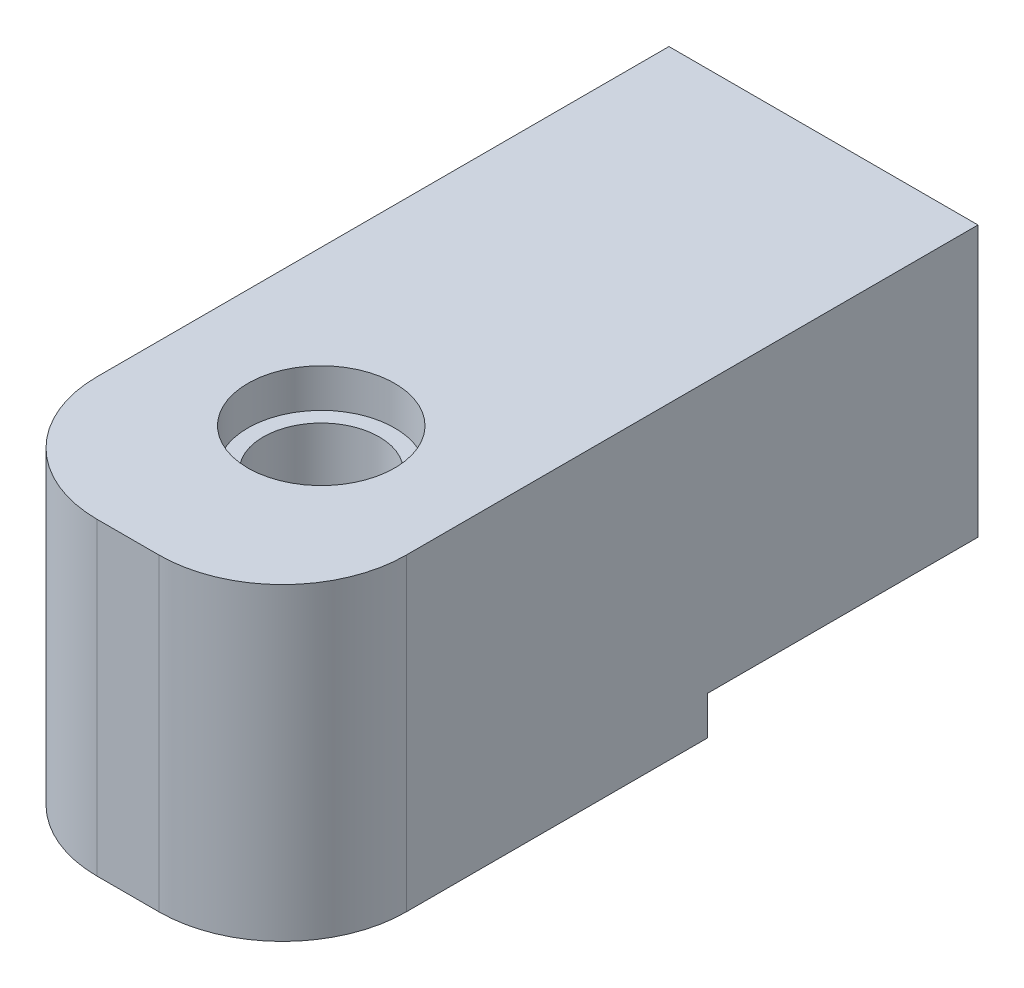
ISO-10303-21;
HEADER;
FILE_DESCRIPTION(('STEP AP214'),'2;1');
FILE_NAME('part.step','',(''),(''),'','','');
FILE_SCHEMA(('AUTOMOTIVE_DESIGN { 1 0 10303 214 1 1 1 1 }'));
ENDSEC;
DATA;
#1=APPLICATION_CONTEXT('core data for automotive mechanical design processes');
#2=APPLICATION_PROTOCOL_DEFINITION('international standard','automotive_design',2000,#1);
#3=PRODUCT_CONTEXT('',#1,'mechanical');
#4=PRODUCT('Part','Part','',(#3));
#5=PRODUCT_RELATED_PRODUCT_CATEGORY('part','',(#4));
#6=PRODUCT_DEFINITION_FORMATION('','',#4);
#7=PRODUCT_DEFINITION_CONTEXT('part definition',#1,'design');
#8=PRODUCT_DEFINITION('design','',#6,#7);
#9=PRODUCT_DEFINITION_SHAPE('','',#8);
#10=(LENGTH_UNIT() NAMED_UNIT(*) SI_UNIT(.MILLI.,.METRE.));
#11=(NAMED_UNIT(*) PLANE_ANGLE_UNIT() SI_UNIT($,.RADIAN.));
#12=(NAMED_UNIT(*) SI_UNIT($,.STERADIAN.) SOLID_ANGLE_UNIT());
#13=UNCERTAINTY_MEASURE_WITH_UNIT(LENGTH_MEASURE(1.E-05),#10,'distance_accuracy_value','');
#14=(GEOMETRIC_REPRESENTATION_CONTEXT(3) GLOBAL_UNCERTAINTY_ASSIGNED_CONTEXT((#13)) GLOBAL_UNIT_ASSIGNED_CONTEXT((#10,
#11,#12)) REPRESENTATION_CONTEXT('',''));
#15=CARTESIAN_POINT('',(0.,0.,0.));
#16=DIRECTION('',(0.,0.,1.));
#17=DIRECTION('',(1.,0.,0.));
#18=AXIS2_PLACEMENT_3D('',#15,#16,#17);
#19=CARTESIAN_POINT('',(12.7,12.7,57.15));
#20=DIRECTION('',(-1.,0.,0.));
#21=DIRECTION('',(0.,-1.,0.));
#22=AXIS2_PLACEMENT_3D('',#19,#20,#21);
#23=PLANE('',#22);
#24=DIRECTION('',(0.,0.,-1.));
#25=VECTOR('',#24,1.);
#26=CARTESIAN_POINT('',(12.7,-12.7,57.15));
#27=LINE('',#26,#25);
#28=CARTESIAN_POINT('',(12.7,-12.7,46.99));
#29=VERTEX_POINT('',#28);
#30=CARTESIAN_POINT('',(12.7,-12.7,22.225));
#31=VERTEX_POINT('',#30);
#32=EDGE_CURVE('E145',#29,#31,#27,.T.);
#33=ORIENTED_EDGE('',*,*,#32,.T.);
#34=DIRECTION('',(0.,-1.,0.));
#35=VECTOR('',#34,1.);
#36=CARTESIAN_POINT('',(12.7,-9.525,22.225));
#37=LINE('',#36,#35);
#38=CARTESIAN_POINT('',(12.7,-9.525,22.225));
#39=VERTEX_POINT('',#38);
#40=EDGE_CURVE('E121',#39,#31,#37,.T.);
#41=ORIENTED_EDGE('',*,*,#40,.F.);
#42=DIRECTION('',(0.,0.,1.));
#43=VECTOR('',#42,1.);
#44=CARTESIAN_POINT('',(12.7,-9.525,0.));
#45=LINE('',#44,#43);
#46=CARTESIAN_POINT('',(12.7,-9.525,0.));
#47=VERTEX_POINT('',#46);
#48=EDGE_CURVE('E109',#47,#39,#45,.T.);
#49=ORIENTED_EDGE('',*,*,#48,.F.);
#50=DIRECTION('',(0.,1.,0.));
#51=VECTOR('',#50,1.);
#52=CARTESIAN_POINT('',(12.7,12.7,0.));
#53=LINE('',#52,#51);
#54=CARTESIAN_POINT('',(12.7,12.7,0.));
#55=VERTEX_POINT('',#54);
#56=EDGE_CURVE('E120',#47,#55,#53,.T.);
#57=ORIENTED_EDGE('',*,*,#56,.T.);
#58=DIRECTION('',(0.,0.,-1.));
#59=VECTOR('',#58,1.);
#60=CARTESIAN_POINT('',(12.7,12.7,57.15));
#61=LINE('',#60,#59);
#62=CARTESIAN_POINT('',(12.7,12.7,46.99));
#63=VERTEX_POINT('',#62);
#64=EDGE_CURVE('E155',#63,#55,#61,.T.);
#65=ORIENTED_EDGE('',*,*,#64,.F.);
#66=DIRECTION('',(0.,1.,0.));
#67=VECTOR('',#66,1.);
#68=CARTESIAN_POINT('',(12.7,-12.7,46.99));
#69=LINE('',#68,#67);
#70=EDGE_CURVE('E11',#63,#29,#69,.F.);
#71=ORIENTED_EDGE('',*,*,#70,.T.);
#72=EDGE_LOOP('',(#33,#41,#49,#57,#65,#71));
#73=FACE_BOUND('',#72,.T.);
#74=ADVANCED_FACE('F42',(#73),#23,.F.);
#75=CARTESIAN_POINT('',(-12.7,12.7,57.15));
#76=DIRECTION('',(0.,-1.,0.));
#77=DIRECTION('',(0.,0.,-1.));
#78=AXIS2_PLACEMENT_3D('',#75,#76,#77);
#79=PLANE('',#78);
#80=CARTESIAN_POINT('',(0.,12.7,41.275));
#81=DIRECTION('',(0.,1.,0.));
#82=DIRECTION('',(0.,0.,1.));
#83=AXIS2_PLACEMENT_3D('',#80,#81,#82);
#84=CIRCLE('',#83,6.0325);
#85=CARTESIAN_POINT('',(0.,12.7,47.3075));
#86=VERTEX_POINT('',#85);
#87=EDGE_CURVE('E220',#86,#86,#84,.T.);
#88=ORIENTED_EDGE('',*,*,#87,.F.);
#89=EDGE_LOOP('',(#88));
#90=FACE_BOUND('',#89,.T.);
#91=DIRECTION('',(0.,0.,-1.));
#92=VECTOR('',#91,1.);
#93=CARTESIAN_POINT('',(-12.7,12.7,57.15));
#94=LINE('',#93,#92);
#95=CARTESIAN_POINT('',(-12.7,12.7,46.99));
#96=VERTEX_POINT('',#95);
#97=CARTESIAN_POINT('',(-12.7,12.7,0.));
#98=VERTEX_POINT('',#97);
#99=EDGE_CURVE('E152',#96,#98,#94,.T.);
#100=ORIENTED_EDGE('',*,*,#99,.F.);
#101=CARTESIAN_POINT('',(-2.54,12.7,46.99));
#102=DIRECTION('',(0.,-1.,0.));
#103=DIRECTION('',(0.,0.,-1.));
#104=AXIS2_PLACEMENT_3D('',#101,#102,#103);
#105=CIRCLE('',#104,10.16);
#106=CARTESIAN_POINT('',(-2.54,12.7,57.15));
#107=VERTEX_POINT('',#106);
#108=EDGE_CURVE('E51',#96,#107,#105,.F.);
#109=ORIENTED_EDGE('',*,*,#108,.T.);
#110=DIRECTION('',(-1.,0.,0.));
#111=VECTOR('',#110,1.);
#112=CARTESIAN_POINT('',(-12.7,12.7,57.15));
#113=LINE('',#112,#111);
#114=CARTESIAN_POINT('',(2.53999999999999,12.7,57.15));
#115=VERTEX_POINT('',#114);
#116=EDGE_CURVE('E144',#115,#107,#113,.T.);
#117=ORIENTED_EDGE('',*,*,#116,.F.);
#118=CARTESIAN_POINT('',(2.53999999999999,12.7,46.99));
#119=DIRECTION('',(0.,-1.,0.));
#120=DIRECTION('',(0.,0.,-1.));
#121=AXIS2_PLACEMENT_3D('',#118,#119,#120);
#122=CIRCLE('',#121,10.16);
#123=EDGE_CURVE('E66',#115,#63,#122,.F.);
#124=ORIENTED_EDGE('',*,*,#123,.T.);
#125=ORIENTED_EDGE('',*,*,#64,.T.);
#126=DIRECTION('',(-1.,0.,0.));
#127=VECTOR('',#126,1.);
#128=CARTESIAN_POINT('',(-12.7,12.7,0.));
#129=LINE('',#128,#127);
#130=EDGE_CURVE('E128',#55,#98,#129,.T.);
#131=ORIENTED_EDGE('',*,*,#130,.T.);
#132=EDGE_LOOP('',(#100,#109,#117,#124,#125,#131));
#133=FACE_BOUND('',#132,.T.);
#134=ADVANCED_FACE('F180',(#90,#133),#79,.F.);
#135=CARTESIAN_POINT('',(-12.7,12.7,57.15));
#136=DIRECTION('',(1.,0.,0.));
#137=DIRECTION('',(0.,1.,0.));
#138=AXIS2_PLACEMENT_3D('',#135,#136,#137);
#139=PLANE('',#138);
#140=DIRECTION('',(0.,0.,-1.));
#141=VECTOR('',#140,1.);
#142=CARTESIAN_POINT('',(-12.7,-9.525,0.));
#143=LINE('',#142,#141);
#144=CARTESIAN_POINT('',(-12.7,-9.525,22.225));
#145=VERTEX_POINT('',#144);
#146=CARTESIAN_POINT('',(-12.7,-9.525,0.));
#147=VERTEX_POINT('',#146);
#148=EDGE_CURVE('E58',#145,#147,#143,.T.);
#149=ORIENTED_EDGE('',*,*,#148,.F.);
#150=DIRECTION('',(0.,-1.,0.));
#151=VECTOR('',#150,1.);
#152=CARTESIAN_POINT('',(-12.7,-9.525,22.225));
#153=LINE('',#152,#151);
#154=CARTESIAN_POINT('',(-12.7,-12.7,22.225));
#155=VERTEX_POINT('',#154);
#156=EDGE_CURVE('E130',#145,#155,#153,.T.);
#157=ORIENTED_EDGE('',*,*,#156,.T.);
#158=DIRECTION('',(0.,0.,-1.));
#159=VECTOR('',#158,1.);
#160=CARTESIAN_POINT('',(-12.7,-12.7,57.15));
#161=LINE('',#160,#159);
#162=CARTESIAN_POINT('',(-12.7,-12.7,46.99));
#163=VERTEX_POINT('',#162);
#164=EDGE_CURVE('E148',#163,#155,#161,.T.);
#165=ORIENTED_EDGE('',*,*,#164,.F.);
#166=DIRECTION('',(0.,-1.,0.));
#167=VECTOR('',#166,1.);
#168=CARTESIAN_POINT('',(-12.7,12.7,46.99));
#169=LINE('',#168,#167);
#170=EDGE_CURVE('E172',#163,#96,#169,.F.);
#171=ORIENTED_EDGE('',*,*,#170,.T.);
#172=ORIENTED_EDGE('',*,*,#99,.T.);
#173=DIRECTION('',(0.,-1.,0.));
#174=VECTOR('',#173,1.);
#175=CARTESIAN_POINT('',(-12.7,12.7,0.));
#176=LINE('',#175,#174);
#177=EDGE_CURVE('E134',#98,#147,#176,.T.);
#178=ORIENTED_EDGE('',*,*,#177,.T.);
#179=EDGE_LOOP('',(#149,#157,#165,#171,#172,#178));
#180=FACE_BOUND('',#179,.T.);
#181=ADVANCED_FACE('F196',(#180),#139,.F.);
#182=CARTESIAN_POINT('',(-12.7,-12.7,57.15));
#183=DIRECTION('',(0.,1.,0.));
#184=DIRECTION('',(0.,0.,1.));
#185=AXIS2_PLACEMENT_3D('',#182,#183,#184);
#186=PLANE('',#185);
#187=CARTESIAN_POINT('',(0.,-12.7,41.275));
#188=DIRECTION('',(0.,-1.,0.));
#189=DIRECTION('',(0.,0.,-1.));
#190=AXIS2_PLACEMENT_3D('',#187,#188,#189);
#191=CIRCLE('',#190,4.7625);
#192=CARTESIAN_POINT('',(0.,-12.7,36.5125));
#193=VERTEX_POINT('',#192);
#194=EDGE_CURVE('E206',#193,#193,#191,.T.);
#195=ORIENTED_EDGE('',*,*,#194,.F.);
#196=EDGE_LOOP('',(#195));
#197=FACE_BOUND('',#196,.T.);
#198=ORIENTED_EDGE('',*,*,#164,.T.);
#199=DIRECTION('',(-1.,0.,0.));
#200=VECTOR('',#199,1.);
#201=CARTESIAN_POINT('',(-12.7,-12.7,22.225));
#202=LINE('',#201,#200);
#203=EDGE_CURVE('E199',#31,#155,#202,.T.);
#204=ORIENTED_EDGE('',*,*,#203,.F.);
#205=ORIENTED_EDGE('',*,*,#32,.F.);
#206=CARTESIAN_POINT('',(2.54,-12.7,46.99));
#207=DIRECTION('',(0.,1.,0.));
#208=DIRECTION('',(0.,0.,1.));
#209=AXIS2_PLACEMENT_3D('',#206,#207,#208);
#210=CIRCLE('',#209,10.16);
#211=CARTESIAN_POINT('',(2.54,-12.7,57.15));
#212=VERTEX_POINT('',#211);
#213=EDGE_CURVE('E166',#29,#212,#210,.F.);
#214=ORIENTED_EDGE('',*,*,#213,.T.);
#215=DIRECTION('',(1.,0.,0.));
#216=VECTOR('',#215,1.);
#217=CARTESIAN_POINT('',(-12.7,-12.7,57.15));
#218=LINE('',#217,#216);
#219=CARTESIAN_POINT('',(-2.54,-12.7,57.15));
#220=VERTEX_POINT('',#219);
#221=EDGE_CURVE('E139',#220,#212,#218,.T.);
#222=ORIENTED_EDGE('',*,*,#221,.F.);
#223=CARTESIAN_POINT('',(-2.54,-12.7,46.99));
#224=DIRECTION('',(0.,1.,0.));
#225=DIRECTION('',(0.,0.,1.));
#226=AXIS2_PLACEMENT_3D('',#223,#224,#225);
#227=CIRCLE('',#226,10.16);
#228=EDGE_CURVE('E169',#220,#163,#227,.F.);
#229=ORIENTED_EDGE('',*,*,#228,.T.);
#230=EDGE_LOOP('',(#198,#204,#205,#214,#222,#229));
#231=FACE_BOUND('',#230,.T.);
#232=ADVANCED_FACE('F193',(#197,#231),#186,.F.);
#233=CARTESIAN_POINT('',(0.,0.,57.15));
#234=DIRECTION('',(0.,0.,1.));
#235=DIRECTION('',(1.,0.,0.));
#236=AXIS2_PLACEMENT_3D('',#233,#234,#235);
#237=PLANE('',#236);
#238=ORIENTED_EDGE('',*,*,#116,.T.);
#239=DIRECTION('',(0.,-1.,0.));
#240=VECTOR('',#239,1.);
#241=CARTESIAN_POINT('',(-2.54,-12.7,57.15));
#242=LINE('',#241,#240);
#243=EDGE_CURVE('E162',#107,#220,#242,.T.);
#244=ORIENTED_EDGE('',*,*,#243,.T.);
#245=ORIENTED_EDGE('',*,*,#221,.T.);
#246=DIRECTION('',(0.,1.,0.));
#247=VECTOR('',#246,1.);
#248=CARTESIAN_POINT('',(2.53999999999999,12.7,57.15));
#249=LINE('',#248,#247);
#250=EDGE_CURVE('E158',#212,#115,#249,.T.);
#251=ORIENTED_EDGE('',*,*,#250,.T.);
#252=EDGE_LOOP('',(#238,#244,#245,#251));
#253=FACE_BOUND('',#252,.T.);
#254=ADVANCED_FACE('F185',(#253),#237,.T.);
#255=CARTESIAN_POINT('',(0.,0.,0.));
#256=DIRECTION('',(0.,0.,1.));
#257=DIRECTION('',(1.,0.,0.));
#258=AXIS2_PLACEMENT_3D('',#255,#256,#257);
#259=PLANE('',#258);
#260=CARTESIAN_POINT('',(0.,0.,0.));
#261=DIRECTION('',(0.,0.,-1.));
#262=DIRECTION('',(-1.,0.,0.));
#263=AXIS2_PLACEMENT_3D('',#260,#261,#262);
#264=CIRCLE('',#263,6.35);
#265=CARTESIAN_POINT('',(-6.35,0.,0.));
#266=VERTEX_POINT('',#265);
#267=EDGE_CURVE('E228',#266,#266,#264,.T.);
#268=ORIENTED_EDGE('',*,*,#267,.F.);
#269=EDGE_LOOP('',(#268));
#270=FACE_BOUND('',#269,.T.);
#271=ORIENTED_EDGE('',*,*,#56,.F.);
#272=DIRECTION('',(1.,0.,0.));
#273=VECTOR('',#272,1.);
#274=CARTESIAN_POINT('',(-12.7,-9.525,0.));
#275=LINE('',#274,#273);
#276=EDGE_CURVE('E106',#147,#47,#275,.T.);
#277=ORIENTED_EDGE('',*,*,#276,.F.);
#278=ORIENTED_EDGE('',*,*,#177,.F.);
#279=ORIENTED_EDGE('',*,*,#130,.F.);
#280=EDGE_LOOP('',(#271,#277,#278,#279));
#281=FACE_BOUND('',#280,.T.);
#282=ADVANCED_FACE('F126',(#270,#281),#259,.F.);
#283=CARTESIAN_POINT('',(-2.54,0.,46.99));
#284=DIRECTION('',(0.,1.,0.));
#285=DIRECTION('',(-1.,0.,0.));
#286=AXIS2_PLACEMENT_3D('',#283,#284,#285);
#287=CYLINDRICAL_SURFACE('',#286,10.16);
#288=ORIENTED_EDGE('',*,*,#108,.F.);
#289=ORIENTED_EDGE('',*,*,#170,.F.);
#290=ORIENTED_EDGE('',*,*,#228,.F.);
#291=ORIENTED_EDGE('',*,*,#243,.F.);
#292=EDGE_LOOP('',(#288,#289,#290,#291));
#293=FACE_BOUND('',#292,.T.);
#294=ADVANCED_FACE('F190',(#293),#287,.T.);
#295=CARTESIAN_POINT('',(2.54,0.,46.99));
#296=DIRECTION('',(0.,-1.,0.));
#297=DIRECTION('',(1.,0.,0.));
#298=AXIS2_PLACEMENT_3D('',#295,#296,#297);
#299=CYLINDRICAL_SURFACE('',#298,10.16);
#300=ORIENTED_EDGE('',*,*,#213,.F.);
#301=ORIENTED_EDGE('',*,*,#70,.F.);
#302=ORIENTED_EDGE('',*,*,#123,.F.);
#303=ORIENTED_EDGE('',*,*,#250,.F.);
#304=EDGE_LOOP('',(#300,#301,#302,#303));
#305=FACE_BOUND('',#304,.T.);
#306=ADVANCED_FACE('F44',(#305),#299,.T.);
#307=CARTESIAN_POINT('',(-12.7,-9.525,22.225));
#308=DIRECTION('',(0.,0.,1.));
#309=DIRECTION('',(1.,0.,0.));
#310=AXIS2_PLACEMENT_3D('',#307,#308,#309);
#311=PLANE('',#310);
#312=ORIENTED_EDGE('',*,*,#203,.T.);
#313=ORIENTED_EDGE('',*,*,#156,.F.);
#314=DIRECTION('',(-1.,0.,0.));
#315=VECTOR('',#314,1.);
#316=CARTESIAN_POINT('',(-12.7,-9.525,22.225));
#317=LINE('',#316,#315);
#318=EDGE_CURVE('E123',#39,#145,#317,.T.);
#319=ORIENTED_EDGE('',*,*,#318,.F.);
#320=ORIENTED_EDGE('',*,*,#40,.T.);
#321=EDGE_LOOP('',(#312,#313,#319,#320));
#322=FACE_BOUND('',#321,.T.);
#323=ADVANCED_FACE('F198',(#322),#311,.F.);
#324=CARTESIAN_POINT('',(0.,-9.525,0.));
#325=DIRECTION('',(0.,1.,0.));
#326=DIRECTION('',(0.,0.,1.));
#327=AXIS2_PLACEMENT_3D('',#324,#325,#326);
#328=PLANE('',#327);
#329=ORIENTED_EDGE('',*,*,#148,.T.);
#330=ORIENTED_EDGE('',*,*,#276,.T.);
#331=ORIENTED_EDGE('',*,*,#48,.T.);
#332=ORIENTED_EDGE('',*,*,#318,.T.);
#333=EDGE_LOOP('',(#329,#330,#331,#332));
#334=FACE_BOUND('',#333,.T.);
#335=ADVANCED_FACE('F108',(#334),#328,.F.);
#336=CARTESIAN_POINT('',(0.,9.525,41.275));
#337=DIRECTION('',(0.,-1.,0.));
#338=DIRECTION('',(0.,0.,-1.));
#339=AXIS2_PLACEMENT_3D('',#336,#337,#338);
#340=CYLINDRICAL_SURFACE('',#339,4.7625);
#341=CARTESIAN_POINT('',(0.,9.525,41.275));
#342=DIRECTION('',(0.,-1.,0.));
#343=DIRECTION('',(0.,0.,-1.));
#344=AXIS2_PLACEMENT_3D('',#341,#342,#343);
#345=CIRCLE('',#344,4.7625);
#346=CARTESIAN_POINT('',(0.,9.525,36.5125));
#347=VERTEX_POINT('',#346);
#348=EDGE_CURVE('E211',#347,#347,#345,.T.);
#349=ORIENTED_EDGE('',*,*,#348,.F.);
#350=EDGE_LOOP('',(#349));
#351=FACE_BOUND('',#350,.T.);
#352=ORIENTED_EDGE('',*,*,#194,.T.);
#353=EDGE_LOOP('',(#352));
#354=FACE_BOUND('',#353,.T.);
#355=ADVANCED_FACE('F319',(#351,#354),#340,.F.);
#356=CARTESIAN_POINT('',(0.,9.525,41.275));
#357=DIRECTION('',(0.,1.,0.));
#358=DIRECTION('',(0.,0.,1.));
#359=AXIS2_PLACEMENT_3D('',#356,#357,#358);
#360=PLANE('',#359);
#361=CARTESIAN_POINT('',(0.,9.525,41.275));
#362=DIRECTION('',(0.,1.,0.));
#363=DIRECTION('',(0.,0.,1.));
#364=AXIS2_PLACEMENT_3D('',#361,#362,#363);
#365=CIRCLE('',#364,6.0325);
#366=CARTESIAN_POINT('',(0.,9.525,47.3075));
#367=VERTEX_POINT('',#366);
#368=EDGE_CURVE('E217',#367,#367,#365,.T.);
#369=ORIENTED_EDGE('',*,*,#368,.T.);
#370=EDGE_LOOP('',(#369));
#371=FACE_BOUND('',#370,.T.);
#372=ORIENTED_EDGE('',*,*,#348,.T.);
#373=EDGE_LOOP('',(#372));
#374=FACE_BOUND('',#373,.T.);
#375=ADVANCED_FACE('F329',(#371,#374),#360,.T.);
#376=CARTESIAN_POINT('',(0.,9.525,41.275));
#377=DIRECTION('',(0.,1.,0.));
#378=DIRECTION('',(0.,0.,1.));
#379=AXIS2_PLACEMENT_3D('',#376,#377,#378);
#380=CYLINDRICAL_SURFACE('',#379,6.0325);
#381=ORIENTED_EDGE('',*,*,#368,.F.);
#382=EDGE_LOOP('',(#381));
#383=FACE_BOUND('',#382,.T.);
#384=ORIENTED_EDGE('',*,*,#87,.T.);
#385=EDGE_LOOP('',(#384));
#386=FACE_BOUND('',#385,.T.);
#387=ADVANCED_FACE('F241',(#383,#386),#380,.F.);
#388=CARTESIAN_POINT('',(0.,0.,30.1752));
#389=DIRECTION('',(0.,0.,-1.));
#390=DIRECTION('',(-1.,0.,0.));
#391=AXIS2_PLACEMENT_3D('',#388,#389,#390);
#392=CYLINDRICAL_SURFACE('',#391,6.35);
#393=CARTESIAN_POINT('',(0.,0.,30.1752));
#394=DIRECTION('',(0.,0.,-1.));
#395=DIRECTION('',(-1.,0.,0.));
#396=AXIS2_PLACEMENT_3D('',#393,#394,#395);
#397=CIRCLE('',#396,6.35);
#398=CARTESIAN_POINT('',(-6.35,0.,30.1752));
#399=VERTEX_POINT('',#398);
#400=EDGE_CURVE('E224',#399,#399,#397,.T.);
#401=ORIENTED_EDGE('',*,*,#400,.F.);
#402=EDGE_LOOP('',(#401));
#403=FACE_BOUND('',#402,.T.);
#404=ORIENTED_EDGE('',*,*,#267,.T.);
#405=EDGE_LOOP('',(#404));
#406=FACE_BOUND('',#405,.T.);
#407=ADVANCED_FACE('F238',(#403,#406),#392,.F.);
#408=CARTESIAN_POINT('',(0.,0.,30.1752));
#409=DIRECTION('',(0.,0.,-1.));
#410=DIRECTION('',(-1.,0.,0.));
#411=AXIS2_PLACEMENT_3D('',#408,#409,#410);
#412=PLANE('',#411);
#413=ORIENTED_EDGE('',*,*,#400,.T.);
#414=EDGE_LOOP('',(#413));
#415=FACE_BOUND('',#414,.T.);
#416=ADVANCED_FACE('F236',(#415),#412,.T.);
#417=CLOSED_SHELL('',(#74,#134,#181,#232,#254,#282,#294,#306,#323,#335,#355,#375,#387,#407,#416));
#418=MANIFOLD_SOLID_BREP('B2',#417);
#419=ADVANCED_BREP_SHAPE_REPRESENTATION('',(#18,#418),#14);
#420=SHAPE_DEFINITION_REPRESENTATION(#9,#419);
ENDSEC;
END-ISO-10303-21;
